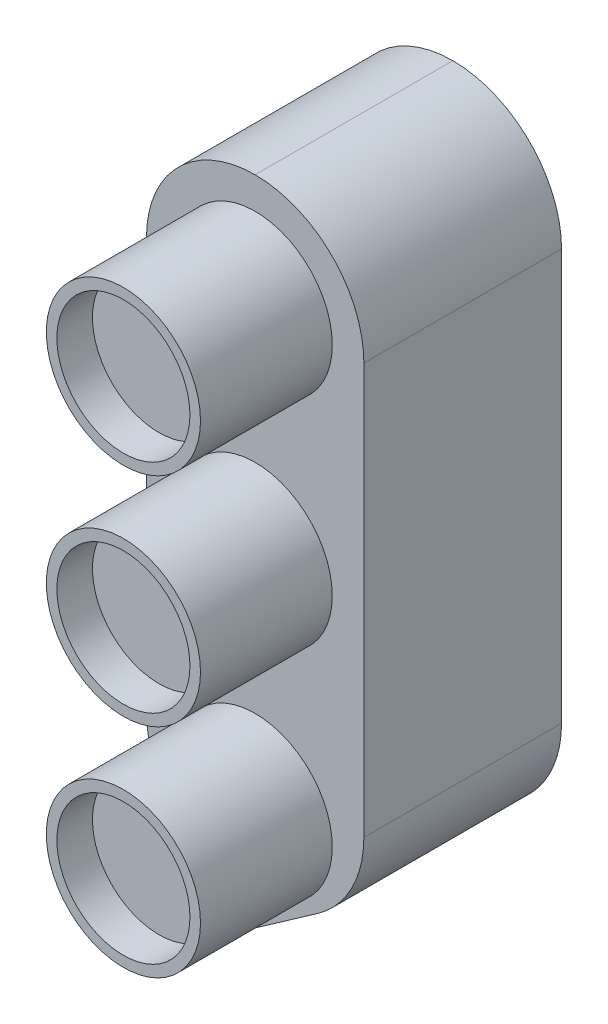
ISO-10303-21;
HEADER;
FILE_DESCRIPTION(('STEP AP214'),'2;1');
FILE_NAME('part.step','',(''),(''),'','','');
FILE_SCHEMA(('AUTOMOTIVE_DESIGN { 1 0 10303 214 1 1 1 1 }'));
ENDSEC;
DATA;
#1=APPLICATION_CONTEXT('core data for automotive mechanical design processes');
#2=APPLICATION_PROTOCOL_DEFINITION('international standard','automotive_design',2000,#1);
#3=PRODUCT_CONTEXT('',#1,'mechanical');
#4=PRODUCT('Part','Part','',(#3));
#5=PRODUCT_RELATED_PRODUCT_CATEGORY('part','',(#4));
#6=PRODUCT_DEFINITION_FORMATION('','',#4);
#7=PRODUCT_DEFINITION_CONTEXT('part definition',#1,'design');
#8=PRODUCT_DEFINITION('design','',#6,#7);
#9=PRODUCT_DEFINITION_SHAPE('','',#8);
#10=(LENGTH_UNIT() NAMED_UNIT(*) SI_UNIT(.MILLI.,.METRE.));
#11=(NAMED_UNIT(*) PLANE_ANGLE_UNIT() SI_UNIT($,.RADIAN.));
#12=(NAMED_UNIT(*) SI_UNIT($,.STERADIAN.) SOLID_ANGLE_UNIT());
#13=UNCERTAINTY_MEASURE_WITH_UNIT(LENGTH_MEASURE(1.E-05),#10,'distance_accuracy_value','');
#14=(GEOMETRIC_REPRESENTATION_CONTEXT(3) GLOBAL_UNCERTAINTY_ASSIGNED_CONTEXT((#13)) GLOBAL_UNIT_ASSIGNED_CONTEXT((#10,
#11,#12)) REPRESENTATION_CONTEXT('',''));
#15=CARTESIAN_POINT('',(0.,0.,0.));
#16=DIRECTION('',(0.,0.,1.));
#17=DIRECTION('',(1.,0.,0.));
#18=AXIS2_PLACEMENT_3D('',#15,#16,#17);
#19=CARTESIAN_POINT('',(-99.,165.,25.));
#20=DIRECTION('',(1.,0.,0.));
#21=DIRECTION('',(0.,1.,0.));
#22=AXIS2_PLACEMENT_3D('',#19,#20,#21);
#23=PLANE('',#22);
#24=DIRECTION('',(0.,-1.,0.));
#25=VECTOR('',#24,1.);
#26=CARTESIAN_POINT('',(-99.,165.,0.));
#27=LINE('',#26,#25);
#28=CARTESIAN_POINT('',(-99.,156.75,0.));
#29=VERTEX_POINT('',#28);
#30=CARTESIAN_POINT('',(-98.9999999999999,125.571390357282,0.));
#31=VERTEX_POINT('',#30);
#32=EDGE_CURVE('E311',#29,#31,#27,.T.);
#33=ORIENTED_EDGE('',*,*,#32,.T.);
#34=DIRECTION('',(0.,0.,-1.));
#35=VECTOR('',#34,1.);
#36=CARTESIAN_POINT('',(-98.9999999999999,125.571390357282,15.));
#37=LINE('',#36,#35);
#38=CARTESIAN_POINT('',(-99.,125.571390357282,15.));
#39=VERTEX_POINT('',#38);
#40=EDGE_CURVE('E388',#31,#39,#37,.F.);
#41=ORIENTED_EDGE('',*,*,#40,.T.);
#42=DIRECTION('',(0.,-1.,0.));
#43=VECTOR('',#42,1.);
#44=CARTESIAN_POINT('',(-98.9999999999999,0.,15.));
#45=LINE('',#44,#43);
#46=CARTESIAN_POINT('',(-99.,156.75,15.));
#47=VERTEX_POINT('',#46);
#48=EDGE_CURVE('E301',#47,#39,#45,.T.);
#49=ORIENTED_EDGE('',*,*,#48,.F.);
#50=DIRECTION('',(0.,0.,-1.));
#51=VECTOR('',#50,1.);
#52=CARTESIAN_POINT('',(-99.,156.75,25.));
#53=LINE('',#52,#51);
#54=EDGE_CURVE('E345',#47,#29,#53,.T.);
#55=ORIENTED_EDGE('',*,*,#54,.T.);
#56=EDGE_LOOP('',(#33,#41,#49,#55));
#57=FACE_BOUND('',#56,.T.);
#58=ADVANCED_FACE('F86',(#57),#23,.F.);
#59=CARTESIAN_POINT('',(-82.4999999999999,165.,25.));
#60=DIRECTION('',(-1.,0.,0.));
#61=DIRECTION('',(0.,-1.,0.));
#62=AXIS2_PLACEMENT_3D('',#59,#60,#61);
#63=PLANE('',#62);
#64=DIRECTION('',(0.,1.,0.));
#65=VECTOR('',#64,1.);
#66=CARTESIAN_POINT('',(-82.5,0.,15.));
#67=LINE('',#66,#65);
#68=CARTESIAN_POINT('',(-82.4999999999999,125.571390357282,15.));
#69=VERTEX_POINT('',#68);
#70=CARTESIAN_POINT('',(-82.4999999999999,156.75,15.));
#71=VERTEX_POINT('',#70);
#72=EDGE_CURVE('E304',#69,#71,#67,.T.);
#73=ORIENTED_EDGE('',*,*,#72,.F.);
#74=DIRECTION('',(0.,0.,1.));
#75=VECTOR('',#74,1.);
#76=CARTESIAN_POINT('',(-82.5,125.571390357282,0.));
#77=LINE('',#76,#75);
#78=CARTESIAN_POINT('',(-82.5,125.571390357282,0.));
#79=VERTEX_POINT('',#78);
#80=EDGE_CURVE('E366',#69,#79,#77,.F.);
#81=ORIENTED_EDGE('',*,*,#80,.T.);
#82=DIRECTION('',(0.,1.,0.));
#83=VECTOR('',#82,1.);
#84=CARTESIAN_POINT('',(-82.4999999999999,165.,0.));
#85=LINE('',#84,#83);
#86=CARTESIAN_POINT('',(-82.4999999999999,156.75,0.));
#87=VERTEX_POINT('',#86);
#88=EDGE_CURVE('E325',#79,#87,#85,.T.);
#89=ORIENTED_EDGE('',*,*,#88,.T.);
#90=DIRECTION('',(0.,0.,-1.));
#91=VECTOR('',#90,1.);
#92=CARTESIAN_POINT('',(-82.4999999999999,156.75,25.));
#93=LINE('',#92,#91);
#94=EDGE_CURVE('E335',#87,#71,#93,.F.);
#95=ORIENTED_EDGE('',*,*,#94,.T.);
#96=EDGE_LOOP('',(#73,#81,#89,#95));
#97=FACE_BOUND('',#96,.T.);
#98=ADVANCED_FACE('F417',(#97),#63,.F.);
#99=CARTESIAN_POINT('',(0.,0.,0.));
#100=DIRECTION('',(0.,0.,1.));
#101=DIRECTION('',(1.,0.,0.));
#102=AXIS2_PLACEMENT_3D('',#99,#100,#101);
#103=PLANE('',#102);
#104=DIRECTION('',(0.,-1.,0.));
#105=VECTOR('',#104,1.);
#106=CARTESIAN_POINT('',(-84.4999999999999,156.75,0.));
#107=LINE('',#106,#105);
#108=CARTESIAN_POINT('',(-84.4999999999999,156.75,0.));
#109=VERTEX_POINT('',#108);
#110=CARTESIAN_POINT('',(-84.5,125.571390357282,0.));
#111=VERTEX_POINT('',#110);
#112=EDGE_CURVE('E238',#109,#111,#107,.T.);
#113=ORIENTED_EDGE('',*,*,#112,.F.);
#114=CARTESIAN_POINT('',(-90.75,156.75,0.));
#115=DIRECTION('',(0.,0.,-1.));
#116=DIRECTION('',(-1.,0.,0.));
#117=AXIS2_PLACEMENT_3D('',#114,#115,#116);
#118=CIRCLE('',#117,6.25);
#119=CARTESIAN_POINT('',(-97.,156.75,0.));
#120=VERTEX_POINT('',#119);
#121=EDGE_CURVE('E198',#120,#109,#118,.T.);
#122=ORIENTED_EDGE('',*,*,#121,.F.);
#123=DIRECTION('',(0.,1.,0.));
#124=VECTOR('',#123,1.);
#125=CARTESIAN_POINT('',(-96.9999999999999,125.571390357282,0.));
#126=LINE('',#125,#124);
#127=CARTESIAN_POINT('',(-96.9999999999999,125.571390357282,0.));
#128=VERTEX_POINT('',#127);
#129=EDGE_CURVE('E220',#128,#120,#126,.T.);
#130=ORIENTED_EDGE('',*,*,#129,.F.);
#131=CARTESIAN_POINT('',(-90.75,125.571390357282,0.));
#132=DIRECTION('',(0.,0.,-1.));
#133=DIRECTION('',(-1.,0.,0.));
#134=AXIS2_PLACEMENT_3D('',#131,#132,#133);
#135=CIRCLE('',#134,6.24999999999999);
#136=CARTESIAN_POINT('',(-94.3348527271939,120.451690080476,0.));
#137=VERTEX_POINT('',#136);
#138=EDGE_CURVE('E253',#137,#128,#135,.T.);
#139=ORIENTED_EDGE('',*,*,#138,.F.);
#140=DIRECTION('',(-0.819152044288985,0.573576436351056,0.));
#141=VECTOR('',#140,1.);
#142=CARTESIAN_POINT('',(-90.75,117.941549177523,0.));
#143=LINE('',#142,#141);
#144=CARTESIAN_POINT('',(-90.75,117.941549177523,0.));
#145=VERTEX_POINT('',#144);
#146=EDGE_CURVE('E249',#145,#137,#143,.T.);
#147=ORIENTED_EDGE('',*,*,#146,.F.);
#148=DIRECTION('',(-0.819152044288993,-0.573576436351045,0.));
#149=VECTOR('',#148,1.);
#150=CARTESIAN_POINT('',(-87.1651472728059,120.451690080476,0.));
#151=LINE('',#150,#149);
#152=CARTESIAN_POINT('',(-87.1651472728059,120.451690080476,0.));
#153=VERTEX_POINT('',#152);
#154=EDGE_CURVE('E245',#153,#145,#151,.T.);
#155=ORIENTED_EDGE('',*,*,#154,.F.);
#156=CARTESIAN_POINT('',(-90.75,125.571390357282,0.));
#157=DIRECTION('',(0.,0.,-1.));
#158=DIRECTION('',(-1.,0.,0.));
#159=AXIS2_PLACEMENT_3D('',#156,#157,#158);
#160=CIRCLE('',#159,6.25);
#161=EDGE_CURVE('E241',#111,#153,#160,.T.);
#162=ORIENTED_EDGE('',*,*,#161,.F.);
#163=EDGE_LOOP('',(#113,#122,#130,#139,#147,#155,#162));
#164=FACE_BOUND('',#163,.T.);
#165=ORIENTED_EDGE('',*,*,#88,.F.);
#166=CARTESIAN_POINT('',(-90.75,125.571390357282,0.));
#167=DIRECTION('',(0.,0.,1.));
#168=DIRECTION('',(1.,0.,0.));
#169=AXIS2_PLACEMENT_3D('',#166,#167,#168);
#170=CIRCLE('',#169,8.25);
#171=CARTESIAN_POINT('',(-86.0179944001038,118.813385991898,0.));
#172=VERTEX_POINT('',#171);
#173=EDGE_CURVE('E377',#79,#172,#170,.F.);
#174=ORIENTED_EDGE('',*,*,#173,.T.);
#175=DIRECTION('',(0.819152044288993,0.573576436351045,0.));
#176=VECTOR('',#175,1.);
#177=CARTESIAN_POINT('',(-82.5,121.27671219023,0.));
#178=LINE('',#177,#176);
#179=CARTESIAN_POINT('',(-90.75,115.5,0.));
#180=VERTEX_POINT('',#179);
#181=EDGE_CURVE('E348',#172,#180,#178,.F.);
#182=ORIENTED_EDGE('',*,*,#181,.T.);
#183=DIRECTION('',(0.819152044288994,-0.573576436351044,0.));
#184=VECTOR('',#183,1.);
#185=CARTESIAN_POINT('',(-90.7499999999999,115.5,0.));
#186=LINE('',#185,#184);
#187=CARTESIAN_POINT('',(-95.4820055998961,118.813385991898,0.));
#188=VERTEX_POINT('',#187);
#189=EDGE_CURVE('E355',#180,#188,#186,.F.);
#190=ORIENTED_EDGE('',*,*,#189,.T.);
#191=CARTESIAN_POINT('',(-90.75,125.571390357282,0.));
#192=DIRECTION('',(0.,0.,1.));
#193=DIRECTION('',(1.,0.,0.));
#194=AXIS2_PLACEMENT_3D('',#191,#192,#193);
#195=CIRCLE('',#194,8.25);
#196=EDGE_CURVE('E374',#188,#31,#195,.F.);
#197=ORIENTED_EDGE('',*,*,#196,.T.);
#198=ORIENTED_EDGE('',*,*,#32,.F.);
#199=CARTESIAN_POINT('',(-90.75,156.75,0.));
#200=DIRECTION('',(0.,0.,1.));
#201=DIRECTION('',(1.,0.,0.));
#202=AXIS2_PLACEMENT_3D('',#199,#200,#201);
#203=CIRCLE('',#202,8.25);
#204=CARTESIAN_POINT('',(-90.75,165.,0.));
#205=VERTEX_POINT('',#204);
#206=EDGE_CURVE('E328',#29,#205,#203,.F.);
#207=ORIENTED_EDGE('',*,*,#206,.T.);
#208=CARTESIAN_POINT('',(-90.7499999999999,156.75,0.));
#209=DIRECTION('',(0.,0.,1.));
#210=DIRECTION('',(1.,0.,0.));
#211=AXIS2_PLACEMENT_3D('',#208,#209,#210);
#212=CIRCLE('',#211,8.25);
#213=EDGE_CURVE('E331',#205,#87,#212,.F.);
#214=ORIENTED_EDGE('',*,*,#213,.T.);
#215=EDGE_LOOP('',(#165,#174,#182,#190,#197,#198,#207,#214));
#216=FACE_BOUND('',#215,.T.);
#217=ADVANCED_FACE('F423',(#164,#216),#103,.F.);
#218=CARTESIAN_POINT('',(-90.75,156.75,15.));
#219=DIRECTION('',(0.,0.,1.));
#220=DIRECTION('',(1.,0.,0.));
#221=AXIS2_PLACEMENT_3D('',#218,#219,#220);
#222=CYLINDRICAL_SURFACE('',#221,5.85);
#223=CARTESIAN_POINT('',(-90.75,156.75,15.));
#224=DIRECTION('',(0.,0.,1.));
#225=DIRECTION('',(1.,0.,0.));
#226=AXIS2_PLACEMENT_3D('',#223,#224,#225);
#227=CIRCLE('',#226,5.85);
#228=CARTESIAN_POINT('',(-84.9,156.75,15.));
#229=VERTEX_POINT('',#228);
#230=EDGE_CURVE('E296',#229,#229,#227,.T.);
#231=ORIENTED_EDGE('',*,*,#230,.T.);
#232=EDGE_LOOP('',(#231));
#233=FACE_BOUND('',#232,.T.);
#234=CARTESIAN_POINT('',(-90.75,156.75,25.));
#235=DIRECTION('',(0.,0.,1.));
#236=DIRECTION('',(1.,0.,0.));
#237=AXIS2_PLACEMENT_3D('',#234,#235,#236);
#238=CIRCLE('',#237,5.85);
#239=CARTESIAN_POINT('',(-84.9,156.75,25.));
#240=VERTEX_POINT('',#239);
#241=EDGE_CURVE('E315',#240,#240,#238,.T.);
#242=ORIENTED_EDGE('',*,*,#241,.F.);
#243=EDGE_LOOP('',(#242));
#244=FACE_BOUND('',#243,.T.);
#245=ADVANCED_FACE('F482',(#233,#244),#222,.T.);
#246=CARTESIAN_POINT('',(-90.75,140.25,15.));
#247=DIRECTION('',(0.,0.,1.));
#248=DIRECTION('',(1.,0.,0.));
#249=AXIS2_PLACEMENT_3D('',#246,#247,#248);
#250=CYLINDRICAL_SURFACE('',#249,5.85);
#251=CARTESIAN_POINT('',(-90.75,140.25,15.));
#252=DIRECTION('',(0.,0.,1.));
#253=DIRECTION('',(1.,0.,0.));
#254=AXIS2_PLACEMENT_3D('',#251,#252,#253);
#255=CIRCLE('',#254,5.85);
#256=CARTESIAN_POINT('',(-84.9,140.25,15.));
#257=VERTEX_POINT('',#256);
#258=EDGE_CURVE('E292',#257,#257,#255,.T.);
#259=ORIENTED_EDGE('',*,*,#258,.T.);
#260=EDGE_LOOP('',(#259));
#261=FACE_BOUND('',#260,.T.);
#262=CARTESIAN_POINT('',(-90.75,140.25,25.));
#263=DIRECTION('',(0.,0.,1.));
#264=DIRECTION('',(1.,0.,0.));
#265=AXIS2_PLACEMENT_3D('',#262,#263,#264);
#266=CIRCLE('',#265,5.85);
#267=CARTESIAN_POINT('',(-84.9,140.25,25.));
#268=VERTEX_POINT('',#267);
#269=EDGE_CURVE('E282',#268,#268,#266,.T.);
#270=ORIENTED_EDGE('',*,*,#269,.F.);
#271=EDGE_LOOP('',(#270));
#272=FACE_BOUND('',#271,.T.);
#273=ADVANCED_FACE('F487',(#261,#272),#250,.T.);
#274=CARTESIAN_POINT('',(-90.7499999999999,123.75,15.));
#275=DIRECTION('',(0.,0.,1.));
#276=DIRECTION('',(1.,0.,0.));
#277=AXIS2_PLACEMENT_3D('',#274,#275,#276);
#278=CYLINDRICAL_SURFACE('',#277,5.85);
#279=CARTESIAN_POINT('',(-90.7499999999999,123.75,15.));
#280=DIRECTION('',(0.,0.,1.));
#281=DIRECTION('',(1.,0.,0.));
#282=AXIS2_PLACEMENT_3D('',#279,#280,#281);
#283=CIRCLE('',#282,5.85);
#284=CARTESIAN_POINT('',(-84.8999999999999,123.75,15.));
#285=VERTEX_POINT('',#284);
#286=EDGE_CURVE('E307',#285,#285,#283,.F.);
#287=ORIENTED_EDGE('',*,*,#286,.F.);
#288=EDGE_LOOP('',(#287));
#289=FACE_BOUND('',#288,.T.);
#290=CARTESIAN_POINT('',(-90.7499999999999,123.75,25.));
#291=DIRECTION('',(0.,0.,1.));
#292=DIRECTION('',(1.,0.,0.));
#293=AXIS2_PLACEMENT_3D('',#290,#291,#292);
#294=CIRCLE('',#293,5.85);
#295=CARTESIAN_POINT('',(-84.8999999999999,123.75,25.));
#296=VERTEX_POINT('',#295);
#297=EDGE_CURVE('E297',#296,#296,#294,.F.);
#298=ORIENTED_EDGE('',*,*,#297,.T.);
#299=EDGE_LOOP('',(#298));
#300=FACE_BOUND('',#299,.T.);
#301=ADVANCED_FACE('F498',(#289,#300),#278,.T.);
#302=CARTESIAN_POINT('',(0.,0.,15.));
#303=DIRECTION('',(0.,0.,1.));
#304=DIRECTION('',(1.,0.,0.));
#305=AXIS2_PLACEMENT_3D('',#302,#303,#304);
#306=PLANE('',#305);
#307=ORIENTED_EDGE('',*,*,#258,.F.);
#308=EDGE_LOOP('',(#307));
#309=FACE_BOUND('',#308,.T.);
#310=ORIENTED_EDGE('',*,*,#230,.F.);
#311=EDGE_LOOP('',(#310));
#312=FACE_BOUND('',#311,.T.);
#313=DIRECTION('',(-0.819152044288993,-0.573576436351045,0.));
#314=VECTOR('',#313,1.);
#315=CARTESIAN_POINT('',(-84.1230848469838,120.140215945218,15.));
#316=LINE('',#315,#314);
#317=CARTESIAN_POINT('',(-90.75,115.5,15.));
#318=VERTEX_POINT('',#317);
#319=CARTESIAN_POINT('',(-86.0179944001038,118.813385991898,15.));
#320=VERTEX_POINT('',#319);
#321=EDGE_CURVE('E359',#318,#320,#316,.F.);
#322=ORIENTED_EDGE('',*,*,#321,.T.);
#323=CARTESIAN_POINT('',(-90.75,125.571390357282,15.));
#324=DIRECTION('',(0.,0.,1.));
#325=DIRECTION('',(1.,0.,0.));
#326=AXIS2_PLACEMENT_3D('',#323,#324,#325);
#327=CIRCLE('',#326,8.25);
#328=EDGE_CURVE('E385',#320,#69,#327,.T.);
#329=ORIENTED_EDGE('',*,*,#328,.T.);
#330=ORIENTED_EDGE('',*,*,#72,.T.);
#331=CARTESIAN_POINT('',(-90.7499999999999,156.75,15.));
#332=DIRECTION('',(0.,0.,1.));
#333=DIRECTION('',(1.,0.,0.));
#334=AXIS2_PLACEMENT_3D('',#331,#332,#333);
#335=CIRCLE('',#334,8.25);
#336=CARTESIAN_POINT('',(-90.75,165.,15.));
#337=VERTEX_POINT('',#336);
#338=EDGE_CURVE('E342',#71,#337,#335,.T.);
#339=ORIENTED_EDGE('',*,*,#338,.T.);
#340=CARTESIAN_POINT('',(-90.75,156.75,15.));
#341=DIRECTION('',(0.,0.,1.));
#342=DIRECTION('',(1.,0.,0.));
#343=AXIS2_PLACEMENT_3D('',#340,#341,#342);
#344=CIRCLE('',#343,8.25);
#345=EDGE_CURVE('E339',#337,#47,#344,.T.);
#346=ORIENTED_EDGE('',*,*,#345,.T.);
#347=ORIENTED_EDGE('',*,*,#48,.T.);
#348=CARTESIAN_POINT('',(-90.75,125.571390357282,15.));
#349=DIRECTION('',(0.,0.,1.));
#350=DIRECTION('',(1.,0.,0.));
#351=AXIS2_PLACEMENT_3D('',#348,#349,#350);
#352=CIRCLE('',#351,8.25);
#353=CARTESIAN_POINT('',(-95.4820055998961,118.813385991898,15.));
#354=VERTEX_POINT('',#353);
#355=EDGE_CURVE('E110',#39,#354,#352,.T.);
#356=ORIENTED_EDGE('',*,*,#355,.T.);
#357=DIRECTION('',(-0.819152044288994,0.573576436351044,0.));
#358=VECTOR('',#357,1.);
#359=CARTESIAN_POINT('',(24.4114128537886,34.8631106088973,15.));
#360=LINE('',#359,#358);
#361=EDGE_CURVE('E363',#354,#318,#360,.F.);
#362=ORIENTED_EDGE('',*,*,#361,.T.);
#363=EDGE_LOOP('',(#322,#329,#330,#339,#346,#347,#356,#362));
#364=FACE_BOUND('',#363,.T.);
#365=ORIENTED_EDGE('',*,*,#286,.T.);
#366=EDGE_LOOP('',(#365));
#367=FACE_BOUND('',#366,.T.);
#368=ADVANCED_FACE('F461',(#309,#312,#364,#367),#306,.T.);
#369=CARTESIAN_POINT('',(0.,0.,25.));
#370=DIRECTION('',(0.,0.,1.));
#371=DIRECTION('',(1.,0.,0.));
#372=AXIS2_PLACEMENT_3D('',#369,#370,#371);
#373=PLANE('',#372);
#374=ORIENTED_EDGE('',*,*,#269,.T.);
#375=EDGE_LOOP('',(#374));
#376=FACE_BOUND('',#375,.T.);
#377=CARTESIAN_POINT('',(-90.75,140.25,25.));
#378=DIRECTION('',(0.,0.,1.));
#379=DIRECTION('',(1.,0.,0.));
#380=AXIS2_PLACEMENT_3D('',#377,#378,#379);
#381=CIRCLE('',#380,5.05);
#382=CARTESIAN_POINT('',(-85.7,140.25,25.));
#383=VERTEX_POINT('',#382);
#384=EDGE_CURVE('E278',#383,#383,#381,.T.);
#385=ORIENTED_EDGE('',*,*,#384,.F.);
#386=EDGE_LOOP('',(#385));
#387=FACE_BOUND('',#386,.T.);
#388=ADVANCED_FACE('F494',(#376,#387),#373,.T.);
#389=ORIENTED_EDGE('',*,*,#241,.T.);
#390=EDGE_LOOP('',(#389));
#391=FACE_BOUND('',#390,.T.);
#392=CARTESIAN_POINT('',(-90.75,156.75,25.));
#393=DIRECTION('',(0.,0.,1.));
#394=DIRECTION('',(1.,0.,0.));
#395=AXIS2_PLACEMENT_3D('',#392,#393,#394);
#396=CIRCLE('',#395,5.05);
#397=CARTESIAN_POINT('',(-85.7,156.75,25.));
#398=VERTEX_POINT('',#397);
#399=EDGE_CURVE('E287',#398,#398,#396,.T.);
#400=ORIENTED_EDGE('',*,*,#399,.F.);
#401=EDGE_LOOP('',(#400));
#402=FACE_BOUND('',#401,.T.);
#403=ADVANCED_FACE('F491',(#391,#402),#373,.T.);
#404=CARTESIAN_POINT('',(-90.75,140.25,15.));
#405=DIRECTION('',(0.,0.,1.));
#406=DIRECTION('',(1.,0.,0.));
#407=AXIS2_PLACEMENT_3D('',#404,#405,#406);
#408=CYLINDRICAL_SURFACE('',#407,5.05);
#409=CARTESIAN_POINT('',(-90.75,140.25,22.3));
#410=DIRECTION('',(0.,0.,1.));
#411=DIRECTION('',(1.,0.,0.));
#412=AXIS2_PLACEMENT_3D('',#409,#410,#411);
#413=CIRCLE('',#412,5.05);
#414=CARTESIAN_POINT('',(-85.7,140.25,22.3));
#415=VERTEX_POINT('',#414);
#416=EDGE_CURVE('E263',#415,#415,#413,.F.);
#417=ORIENTED_EDGE('',*,*,#416,.T.);
#418=EDGE_LOOP('',(#417));
#419=FACE_BOUND('',#418,.T.);
#420=ORIENTED_EDGE('',*,*,#384,.T.);
#421=EDGE_LOOP('',(#420));
#422=FACE_BOUND('',#421,.T.);
#423=ADVANCED_FACE('F400',(#419,#422),#408,.F.);
#424=CARTESIAN_POINT('',(-90.75,156.75,15.));
#425=DIRECTION('',(0.,0.,1.));
#426=DIRECTION('',(1.,0.,0.));
#427=AXIS2_PLACEMENT_3D('',#424,#425,#426);
#428=CYLINDRICAL_SURFACE('',#427,5.05);
#429=CARTESIAN_POINT('',(-90.75,156.75,22.3));
#430=DIRECTION('',(0.,0.,1.));
#431=DIRECTION('',(1.,0.,0.));
#432=AXIS2_PLACEMENT_3D('',#429,#430,#431);
#433=CIRCLE('',#432,5.05);
#434=CARTESIAN_POINT('',(-85.7,156.75,22.3));
#435=VERTEX_POINT('',#434);
#436=EDGE_CURVE('E370',#435,#435,#433,.F.);
#437=ORIENTED_EDGE('',*,*,#436,.T.);
#438=EDGE_LOOP('',(#437));
#439=FACE_BOUND('',#438,.T.);
#440=ORIENTED_EDGE('',*,*,#399,.T.);
#441=EDGE_LOOP('',(#440));
#442=FACE_BOUND('',#441,.T.);
#443=ADVANCED_FACE('F507',(#439,#442),#428,.F.);
#444=CARTESIAN_POINT('',(-90.7499999999999,123.75,25.));
#445=DIRECTION('',(0.,0.,1.));
#446=DIRECTION('',(1.,0.,0.));
#447=AXIS2_PLACEMENT_3D('',#444,#445,#446);
#448=CIRCLE('',#447,5.05);
#449=CARTESIAN_POINT('',(-85.6999999999999,123.75,25.));
#450=VERTEX_POINT('',#449);
#451=EDGE_CURVE('E283',#450,#450,#448,.F.);
#452=ORIENTED_EDGE('',*,*,#451,.T.);
#453=EDGE_LOOP('',(#452));
#454=FACE_BOUND('',#453,.T.);
#455=ORIENTED_EDGE('',*,*,#297,.F.);
#456=EDGE_LOOP('',(#455));
#457=FACE_BOUND('',#456,.T.);
#458=ADVANCED_FACE('F496',(#454,#457),#373,.T.);
#459=CARTESIAN_POINT('',(-90.7499999999999,123.75,15.));
#460=DIRECTION('',(0.,0.,1.));
#461=DIRECTION('',(1.,0.,0.));
#462=AXIS2_PLACEMENT_3D('',#459,#460,#461);
#463=CYLINDRICAL_SURFACE('',#462,5.05);
#464=CARTESIAN_POINT('',(-90.7499999999999,123.75,22.3));
#465=DIRECTION('',(0.,0.,1.));
#466=DIRECTION('',(1.,0.,0.));
#467=AXIS2_PLACEMENT_3D('',#464,#465,#466);
#468=CIRCLE('',#467,5.05);
#469=CARTESIAN_POINT('',(-85.6999999999999,123.75,22.3));
#470=VERTEX_POINT('',#469);
#471=EDGE_CURVE('E12',#470,#470,#468,.T.);
#472=ORIENTED_EDGE('',*,*,#471,.F.);
#473=EDGE_LOOP('',(#472));
#474=FACE_BOUND('',#473,.T.);
#475=ORIENTED_EDGE('',*,*,#451,.F.);
#476=EDGE_LOOP('',(#475));
#477=FACE_BOUND('',#476,.T.);
#478=ADVANCED_FACE('F436',(#474,#477),#463,.F.);
#479=CARTESIAN_POINT('',(-90.75,156.75,25.));
#480=DIRECTION('',(0.,0.,-1.));
#481=DIRECTION('',(-1.,0.,0.));
#482=AXIS2_PLACEMENT_3D('',#479,#480,#481);
#483=CYLINDRICAL_SURFACE('',#482,8.25);
#484=ORIENTED_EDGE('',*,*,#54,.F.);
#485=ORIENTED_EDGE('',*,*,#345,.F.);
#486=DIRECTION('',(0.,0.,-1.));
#487=VECTOR('',#486,1.);
#488=CARTESIAN_POINT('',(-90.75,165.,25.));
#489=LINE('',#488,#487);
#490=EDGE_CURVE('E291',#205,#337,#489,.F.);
#491=ORIENTED_EDGE('',*,*,#490,.F.);
#492=ORIENTED_EDGE('',*,*,#206,.F.);
#493=EDGE_LOOP('',(#484,#485,#491,#492));
#494=FACE_BOUND('',#493,.T.);
#495=ADVANCED_FACE('F432',(#494),#483,.T.);
#496=CARTESIAN_POINT('',(-90.7499999999999,156.75,25.));
#497=DIRECTION('',(0.,0.,-1.));
#498=DIRECTION('',(-1.,0.,0.));
#499=AXIS2_PLACEMENT_3D('',#496,#497,#498);
#500=CYLINDRICAL_SURFACE('',#499,8.25);
#501=ORIENTED_EDGE('',*,*,#338,.F.);
#502=ORIENTED_EDGE('',*,*,#94,.F.);
#503=ORIENTED_EDGE('',*,*,#213,.F.);
#504=ORIENTED_EDGE('',*,*,#490,.T.);
#505=EDGE_LOOP('',(#501,#502,#503,#504));
#506=FACE_BOUND('',#505,.T.);
#507=ADVANCED_FACE('F428',(#506),#500,.T.);
#508=CARTESIAN_POINT('',(-82.5,121.27671219023,25.));
#509=DIRECTION('',(-0.573576436351044,0.819152044288993,0.));
#510=DIRECTION('',(0.,0.,-1.));
#511=AXIS2_PLACEMENT_3D('',#508,#509,#510);
#512=PLANE('',#511);
#513=ORIENTED_EDGE('',*,*,#181,.F.);
#514=DIRECTION('',(0.,0.,-1.));
#515=VECTOR('',#514,1.);
#516=CARTESIAN_POINT('',(-86.0179944001038,118.813385991898,15.));
#517=LINE('',#516,#515);
#518=EDGE_CURVE('E380',#172,#320,#517,.F.);
#519=ORIENTED_EDGE('',*,*,#518,.T.);
#520=ORIENTED_EDGE('',*,*,#321,.F.);
#521=DIRECTION('',(0.,0.,1.));
#522=VECTOR('',#521,1.);
#523=CARTESIAN_POINT('',(-90.75,115.5,25.));
#524=LINE('',#523,#522);
#525=EDGE_CURVE('E352',#180,#318,#524,.T.);
#526=ORIENTED_EDGE('',*,*,#525,.F.);
#527=EDGE_LOOP('',(#513,#519,#520,#526));
#528=FACE_BOUND('',#527,.T.);
#529=ADVANCED_FACE('F431',(#528),#512,.F.);
#530=CARTESIAN_POINT('',(-90.7499999999999,115.5,25.));
#531=DIRECTION('',(0.573576436351044,0.819152044288993,0.));
#532=DIRECTION('',(0.,0.,-1.));
#533=AXIS2_PLACEMENT_3D('',#530,#531,#532);
#534=PLANE('',#533);
#535=ORIENTED_EDGE('',*,*,#361,.F.);
#536=DIRECTION('',(0.,0.,1.));
#537=VECTOR('',#536,1.);
#538=CARTESIAN_POINT('',(-95.4820055998961,118.813385991898,0.));
#539=LINE('',#538,#537);
#540=EDGE_CURVE('E95',#354,#188,#539,.F.);
#541=ORIENTED_EDGE('',*,*,#540,.T.);
#542=ORIENTED_EDGE('',*,*,#189,.F.);
#543=ORIENTED_EDGE('',*,*,#525,.T.);
#544=EDGE_LOOP('',(#535,#541,#542,#543));
#545=FACE_BOUND('',#544,.T.);
#546=ADVANCED_FACE('F439',(#545),#534,.F.);
#547=CARTESIAN_POINT('',(-90.75,125.571390357282,25.));
#548=DIRECTION('',(0.,0.,-1.));
#549=DIRECTION('',(-1.,0.,0.));
#550=AXIS2_PLACEMENT_3D('',#547,#548,#549);
#551=CYLINDRICAL_SURFACE('',#550,8.25);
#552=ORIENTED_EDGE('',*,*,#328,.F.);
#553=ORIENTED_EDGE('',*,*,#518,.F.);
#554=ORIENTED_EDGE('',*,*,#173,.F.);
#555=ORIENTED_EDGE('',*,*,#80,.F.);
#556=EDGE_LOOP('',(#552,#553,#554,#555));
#557=FACE_BOUND('',#556,.T.);
#558=ADVANCED_FACE('F445',(#557),#551,.T.);
#559=CARTESIAN_POINT('',(-90.75,125.571390357282,25.));
#560=DIRECTION('',(0.,0.,1.));
#561=DIRECTION('',(1.,0.,0.));
#562=AXIS2_PLACEMENT_3D('',#559,#560,#561);
#563=CYLINDRICAL_SURFACE('',#562,8.25);
#564=ORIENTED_EDGE('',*,*,#196,.F.);
#565=ORIENTED_EDGE('',*,*,#540,.F.);
#566=ORIENTED_EDGE('',*,*,#355,.F.);
#567=ORIENTED_EDGE('',*,*,#40,.F.);
#568=EDGE_LOOP('',(#564,#565,#566,#567));
#569=FACE_BOUND('',#568,.T.);
#570=ADVANCED_FACE('F88',(#569),#563,.T.);
#571=CARTESIAN_POINT('',(-90.75,156.75,22.3));
#572=DIRECTION('',(0.,0.,1.));
#573=DIRECTION('',(1.,0.,0.));
#574=AXIS2_PLACEMENT_3D('',#571,#572,#573);
#575=PLANE('',#574);
#576=ORIENTED_EDGE('',*,*,#436,.F.);
#577=EDGE_LOOP('',(#576));
#578=FACE_BOUND('',#577,.T.);
#579=ADVANCED_FACE('F406',(#578),#575,.T.);
#580=CARTESIAN_POINT('',(-90.75,140.25,22.3));
#581=DIRECTION('',(0.,0.,1.));
#582=DIRECTION('',(1.,0.,0.));
#583=AXIS2_PLACEMENT_3D('',#580,#581,#582);
#584=PLANE('',#583);
#585=ORIENTED_EDGE('',*,*,#416,.F.);
#586=EDGE_LOOP('',(#585));
#587=FACE_BOUND('',#586,.T.);
#588=ADVANCED_FACE('F403',(#587),#584,.T.);
#589=CARTESIAN_POINT('',(-90.7499999999999,123.75,22.3));
#590=DIRECTION('',(0.,0.,1.));
#591=DIRECTION('',(1.,0.,0.));
#592=AXIS2_PLACEMENT_3D('',#589,#590,#591);
#593=PLANE('',#592);
#594=ORIENTED_EDGE('',*,*,#471,.T.);
#595=EDGE_LOOP('',(#594));
#596=FACE_BOUND('',#595,.T.);
#597=ADVANCED_FACE('F405',(#596),#593,.T.);
#598=CARTESIAN_POINT('',(-90.75,156.75,9.));
#599=DIRECTION('',(0.,0.,-1.));
#600=DIRECTION('',(-1.,0.,0.));
#601=AXIS2_PLACEMENT_3D('',#598,#599,#600);
#602=CYLINDRICAL_SURFACE('',#601,6.25);
#603=ORIENTED_EDGE('',*,*,#121,.T.);
#604=DIRECTION('',(0.,0.,-1.));
#605=VECTOR('',#604,1.);
#606=CARTESIAN_POINT('',(-84.4999999999999,156.75,9.));
#607=LINE('',#606,#605);
#608=CARTESIAN_POINT('',(-84.4999999999999,156.75,9.));
#609=VERTEX_POINT('',#608);
#610=EDGE_CURVE('E102',#609,#109,#607,.T.);
#611=ORIENTED_EDGE('',*,*,#610,.F.);
#612=CARTESIAN_POINT('',(-90.7499999999999,156.75,9.));
#613=DIRECTION('',(0.,0.,-1.));
#614=DIRECTION('',(-1.,0.,0.));
#615=AXIS2_PLACEMENT_3D('',#612,#613,#614);
#616=CIRCLE('',#615,6.25);
#617=CARTESIAN_POINT('',(-97.,156.75,9.));
#618=VERTEX_POINT('',#617);
#619=EDGE_CURVE('E195',#618,#609,#616,.T.);
#620=ORIENTED_EDGE('',*,*,#619,.F.);
#621=DIRECTION('',(0.,0.,-1.));
#622=VECTOR('',#621,1.);
#623=CARTESIAN_POINT('',(-97.,156.75,9.));
#624=LINE('',#623,#622);
#625=EDGE_CURVE('E260',#618,#120,#624,.T.);
#626=ORIENTED_EDGE('',*,*,#625,.T.);
#627=EDGE_LOOP('',(#603,#611,#620,#626));
#628=FACE_BOUND('',#627,.T.);
#629=ADVANCED_FACE('F193',(#628),#602,.F.);
#630=CARTESIAN_POINT('',(-96.9999999999999,125.571390357282,9.));
#631=DIRECTION('',(-1.,0.,0.));
#632=DIRECTION('',(0.,-1.,0.));
#633=AXIS2_PLACEMENT_3D('',#630,#631,#632);
#634=PLANE('',#633);
#635=ORIENTED_EDGE('',*,*,#129,.T.);
#636=ORIENTED_EDGE('',*,*,#625,.F.);
#637=DIRECTION('',(0.,1.,0.));
#638=VECTOR('',#637,1.);
#639=CARTESIAN_POINT('',(-96.9999999999999,125.571390357282,9.));
#640=LINE('',#639,#638);
#641=CARTESIAN_POINT('',(-96.9999999999999,125.571390357282,9.));
#642=VERTEX_POINT('',#641);
#643=EDGE_CURVE('E202',#642,#618,#640,.T.);
#644=ORIENTED_EDGE('',*,*,#643,.F.);
#645=DIRECTION('',(0.,0.,-1.));
#646=VECTOR('',#645,1.);
#647=CARTESIAN_POINT('',(-96.9999999999999,125.571390357282,9.));
#648=LINE('',#647,#646);
#649=EDGE_CURVE('E264',#642,#128,#648,.T.);
#650=ORIENTED_EDGE('',*,*,#649,.T.);
#651=EDGE_LOOP('',(#635,#636,#644,#650));
#652=FACE_BOUND('',#651,.T.);
#653=ADVANCED_FACE('F591',(#652),#634,.F.);
#654=CARTESIAN_POINT('',(-90.75,125.571390357282,9.));
#655=DIRECTION('',(0.,0.,-1.));
#656=DIRECTION('',(-1.,0.,0.));
#657=AXIS2_PLACEMENT_3D('',#654,#655,#656);
#658=CYLINDRICAL_SURFACE('',#657,6.24999999999999);
#659=ORIENTED_EDGE('',*,*,#138,.T.);
#660=ORIENTED_EDGE('',*,*,#649,.F.);
#661=CARTESIAN_POINT('',(-90.75,125.571390357282,9.));
#662=DIRECTION('',(0.,0.,-1.));
#663=DIRECTION('',(-1.,0.,0.));
#664=AXIS2_PLACEMENT_3D('',#661,#662,#663);
#665=CIRCLE('',#664,6.24999999999999);
#666=CARTESIAN_POINT('',(-94.3348527271939,120.451690080476,9.));
#667=VERTEX_POINT('',#666);
#668=EDGE_CURVE('E233',#667,#642,#665,.T.);
#669=ORIENTED_EDGE('',*,*,#668,.F.);
#670=DIRECTION('',(0.,0.,-1.));
#671=VECTOR('',#670,1.);
#672=CARTESIAN_POINT('',(-94.3348527271939,120.451690080476,9.));
#673=LINE('',#672,#671);
#674=EDGE_CURVE('E267',#667,#137,#673,.T.);
#675=ORIENTED_EDGE('',*,*,#674,.T.);
#676=EDGE_LOOP('',(#659,#660,#669,#675));
#677=FACE_BOUND('',#676,.T.);
#678=ADVANCED_FACE('F600',(#677),#658,.F.);
#679=CARTESIAN_POINT('',(-90.75,117.941549177523,9.));
#680=DIRECTION('',(-0.573576436351056,-0.819152044288985,0.));
#681=DIRECTION('',(0.819152044288985,-0.573576436351056,0.));
#682=AXIS2_PLACEMENT_3D('',#679,#680,#681);
#683=PLANE('',#682);
#684=ORIENTED_EDGE('',*,*,#146,.T.);
#685=ORIENTED_EDGE('',*,*,#674,.F.);
#686=DIRECTION('',(-0.819152044288985,0.573576436351056,0.));
#687=VECTOR('',#686,1.);
#688=CARTESIAN_POINT('',(-90.75,117.941549177523,9.));
#689=LINE('',#688,#687);
#690=CARTESIAN_POINT('',(-90.75,117.941549177523,9.));
#691=VERTEX_POINT('',#690);
#692=EDGE_CURVE('E229',#691,#667,#689,.T.);
#693=ORIENTED_EDGE('',*,*,#692,.F.);
#694=DIRECTION('',(0.,0.,-1.));
#695=VECTOR('',#694,1.);
#696=CARTESIAN_POINT('',(-90.75,117.941549177523,9.));
#697=LINE('',#696,#695);
#698=EDGE_CURVE('E270',#691,#145,#697,.T.);
#699=ORIENTED_EDGE('',*,*,#698,.T.);
#700=EDGE_LOOP('',(#684,#685,#693,#699));
#701=FACE_BOUND('',#700,.T.);
#702=ADVANCED_FACE('F610',(#701),#683,.F.);
#703=CARTESIAN_POINT('',(-87.1651472728059,120.451690080476,9.));
#704=DIRECTION('',(0.573576436351045,-0.819152044288993,0.));
#705=DIRECTION('',(0.819152044288993,0.573576436351045,0.));
#706=AXIS2_PLACEMENT_3D('',#703,#704,#705);
#707=PLANE('',#706);
#708=ORIENTED_EDGE('',*,*,#154,.T.);
#709=ORIENTED_EDGE('',*,*,#698,.F.);
#710=DIRECTION('',(-0.819152044288993,-0.573576436351045,0.));
#711=VECTOR('',#710,1.);
#712=CARTESIAN_POINT('',(-87.1651472728059,120.451690080476,9.));
#713=LINE('',#712,#711);
#714=CARTESIAN_POINT('',(-87.1651472728059,120.451690080476,9.));
#715=VERTEX_POINT('',#714);
#716=EDGE_CURVE('E225',#715,#691,#713,.T.);
#717=ORIENTED_EDGE('',*,*,#716,.F.);
#718=DIRECTION('',(0.,0.,-1.));
#719=VECTOR('',#718,1.);
#720=CARTESIAN_POINT('',(-87.1651472728059,120.451690080476,9.));
#721=LINE('',#720,#719);
#722=EDGE_CURVE('E273',#715,#153,#721,.T.);
#723=ORIENTED_EDGE('',*,*,#722,.T.);
#724=EDGE_LOOP('',(#708,#709,#717,#723));
#725=FACE_BOUND('',#724,.T.);
#726=ADVANCED_FACE('F620',(#725),#707,.F.);
#727=CARTESIAN_POINT('',(-90.75,125.571390357282,9.));
#728=DIRECTION('',(0.,0.,-1.));
#729=DIRECTION('',(-1.,0.,0.));
#730=AXIS2_PLACEMENT_3D('',#727,#728,#729);
#731=CYLINDRICAL_SURFACE('',#730,6.25);
#732=ORIENTED_EDGE('',*,*,#161,.T.);
#733=ORIENTED_EDGE('',*,*,#722,.F.);
#734=CARTESIAN_POINT('',(-90.75,125.571390357282,9.));
#735=DIRECTION('',(0.,0.,-1.));
#736=DIRECTION('',(-1.,0.,0.));
#737=AXIS2_PLACEMENT_3D('',#734,#735,#736);
#738=CIRCLE('',#737,6.25);
#739=CARTESIAN_POINT('',(-84.5,125.571390357282,9.));
#740=VERTEX_POINT('',#739);
#741=EDGE_CURVE('E211',#740,#715,#738,.T.);
#742=ORIENTED_EDGE('',*,*,#741,.F.);
#743=DIRECTION('',(0.,0.,-1.));
#744=VECTOR('',#743,1.);
#745=CARTESIAN_POINT('',(-84.5,125.571390357282,9.));
#746=LINE('',#745,#744);
#747=EDGE_CURVE('E201',#740,#111,#746,.T.);
#748=ORIENTED_EDGE('',*,*,#747,.T.);
#749=EDGE_LOOP('',(#732,#733,#742,#748));
#750=FACE_BOUND('',#749,.T.);
#751=ADVANCED_FACE('F630',(#750),#731,.F.);
#752=CARTESIAN_POINT('',(-84.4999999999999,156.75,9.));
#753=DIRECTION('',(1.,0.,0.));
#754=DIRECTION('',(0.,1.,0.));
#755=AXIS2_PLACEMENT_3D('',#752,#753,#754);
#756=PLANE('',#755);
#757=ORIENTED_EDGE('',*,*,#112,.T.);
#758=ORIENTED_EDGE('',*,*,#747,.F.);
#759=DIRECTION('',(0.,-1.,0.));
#760=VECTOR('',#759,1.);
#761=CARTESIAN_POINT('',(-84.4999999999999,156.75,9.));
#762=LINE('',#761,#760);
#763=EDGE_CURVE('E205',#609,#740,#762,.T.);
#764=ORIENTED_EDGE('',*,*,#763,.F.);
#765=ORIENTED_EDGE('',*,*,#610,.T.);
#766=EDGE_LOOP('',(#757,#758,#764,#765));
#767=FACE_BOUND('',#766,.T.);
#768=ADVANCED_FACE('F206',(#767),#756,.F.);
#769=CARTESIAN_POINT('',(-90.7499999999999,156.75,9.));
#770=DIRECTION('',(0.,0.,-1.));
#771=DIRECTION('',(-1.,0.,0.));
#772=AXIS2_PLACEMENT_3D('',#769,#770,#771);
#773=PLANE('',#772);
#774=ORIENTED_EDGE('',*,*,#619,.T.);
#775=ORIENTED_EDGE('',*,*,#763,.T.);
#776=ORIENTED_EDGE('',*,*,#741,.T.);
#777=ORIENTED_EDGE('',*,*,#716,.T.);
#778=ORIENTED_EDGE('',*,*,#692,.T.);
#779=ORIENTED_EDGE('',*,*,#668,.T.);
#780=ORIENTED_EDGE('',*,*,#643,.T.);
#781=EDGE_LOOP('',(#774,#775,#776,#777,#778,#779,#780));
#782=FACE_BOUND('',#781,.T.);
#783=ADVANCED_FACE('F214',(#782),#773,.T.);
#784=CLOSED_SHELL('',(#58,#98,#217,#245,#273,#301,#368,#388,#403,#423,#443,#458,#478,#495,#507,
#529,#546,#558,#570,#579,#588,#597,#629,#653,#678,#702,#726,#751,#768,#783));
#785=MANIFOLD_SOLID_BREP('B2',#784);
#786=ADVANCED_BREP_SHAPE_REPRESENTATION('',(#18,#785),#14);
#787=SHAPE_DEFINITION_REPRESENTATION(#9,#786);
ENDSEC;
END-ISO-10303-21;
